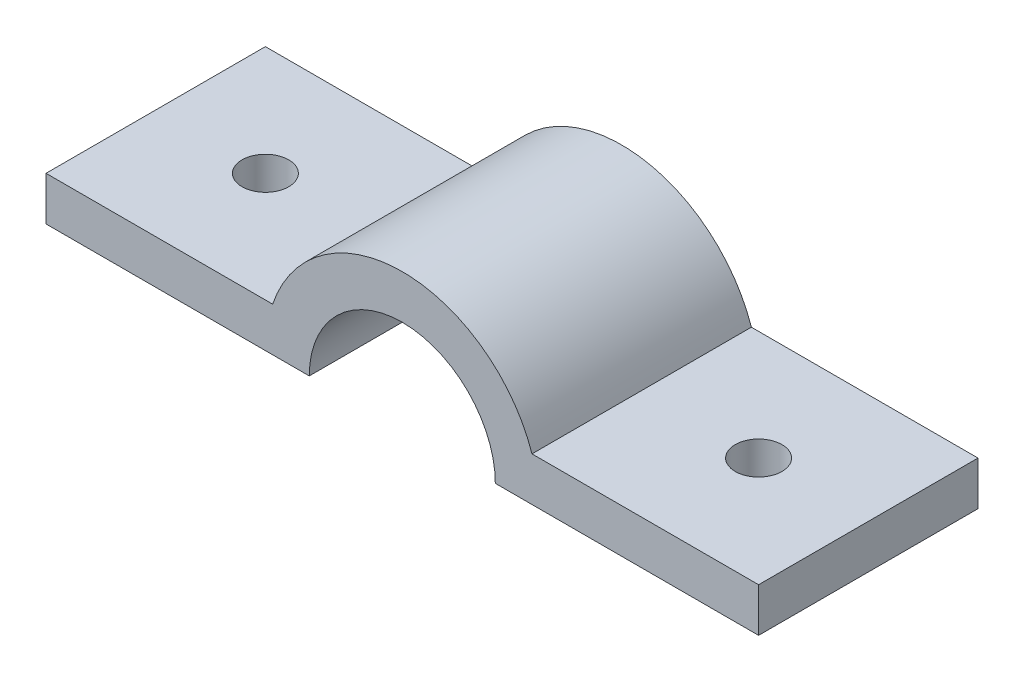
ISO-10303-21;
HEADER;
FILE_DESCRIPTION(('STEP AP214'),'2;1');
FILE_NAME('part.step','',(''),(''),'','','');
FILE_SCHEMA(('AUTOMOTIVE_DESIGN { 1 0 10303 214 1 1 1 1 }'));
ENDSEC;
DATA;
#1=APPLICATION_CONTEXT('core data for automotive mechanical design processes');
#2=APPLICATION_PROTOCOL_DEFINITION('international standard','automotive_design',2000,#1);
#3=PRODUCT_CONTEXT('',#1,'mechanical');
#4=PRODUCT('Part','Part','',(#3));
#5=PRODUCT_RELATED_PRODUCT_CATEGORY('part','',(#4));
#6=PRODUCT_DEFINITION_FORMATION('','',#4);
#7=PRODUCT_DEFINITION_CONTEXT('part definition',#1,'design');
#8=PRODUCT_DEFINITION('design','',#6,#7);
#9=PRODUCT_DEFINITION_SHAPE('','',#8);
#10=(LENGTH_UNIT() NAMED_UNIT(*) SI_UNIT(.MILLI.,.METRE.));
#11=(NAMED_UNIT(*) PLANE_ANGLE_UNIT() SI_UNIT($,.RADIAN.));
#12=(NAMED_UNIT(*) SI_UNIT($,.STERADIAN.) SOLID_ANGLE_UNIT());
#13=UNCERTAINTY_MEASURE_WITH_UNIT(LENGTH_MEASURE(1.E-05),#10,'distance_accuracy_value','');
#14=(GEOMETRIC_REPRESENTATION_CONTEXT(3) GLOBAL_UNCERTAINTY_ASSIGNED_CONTEXT((#13)) GLOBAL_UNIT_ASSIGNED_CONTEXT((#10,
#11,#12)) REPRESENTATION_CONTEXT('',''));
#15=CARTESIAN_POINT('',(0.,0.,0.));
#16=DIRECTION('',(0.,0.,1.));
#17=DIRECTION('',(1.,0.,0.));
#18=AXIS2_PLACEMENT_3D('',#15,#16,#17);
#19=CARTESIAN_POINT('',(51.562,-2.20309881449055E-13,31.75));
#20=DIRECTION('',(0.,0.,-1.));
#21=DIRECTION('',(-1.,0.,0.));
#22=AXIS2_PLACEMENT_3D('',#19,#20,#21);
#23=CYLINDRICAL_SURFACE('',#22,19.8120000001747);
#24=CARTESIAN_POINT('',(51.562,-2.20309881449055E-13,0.));
#25=DIRECTION('',(0.,0.,1.));
#26=DIRECTION('',(-1.,0.,0.));
#27=AXIS2_PLACEMENT_3D('',#24,#25,#26);
#28=CIRCLE('',#27,19.8120000001747);
#29=CARTESIAN_POINT('',(70.3288016456433,6.34999999999999,0.));
#30=VERTEX_POINT('',#29);
#31=CARTESIAN_POINT('',(32.7951983543567,6.35,0.));
#32=VERTEX_POINT('',#31);
#33=EDGE_CURVE('E129',#30,#32,#28,.T.);
#34=ORIENTED_EDGE('',*,*,#33,.T.);
#35=DIRECTION('',(0.,0.,-1.));
#36=VECTOR('',#35,1.);
#37=CARTESIAN_POINT('',(32.7951983543567,6.35,31.75));
#38=LINE('',#37,#36);
#39=CARTESIAN_POINT('',(32.7951983543567,6.35,31.75));
#40=VERTEX_POINT('',#39);
#41=EDGE_CURVE('E11',#40,#32,#38,.T.);
#42=ORIENTED_EDGE('',*,*,#41,.F.);
#43=CARTESIAN_POINT('',(51.562,-2.20309881449055E-13,31.75));
#44=DIRECTION('',(0.,0.,1.));
#45=DIRECTION('',(-1.,0.,0.));
#46=AXIS2_PLACEMENT_3D('',#43,#44,#45);
#47=CIRCLE('',#46,19.8120000001747);
#48=CARTESIAN_POINT('',(70.3288016456433,6.34999999999999,31.75));
#49=VERTEX_POINT('',#48);
#50=EDGE_CURVE('E144',#49,#40,#47,.T.);
#51=ORIENTED_EDGE('',*,*,#50,.F.);
#52=DIRECTION('',(0.,0.,-1.));
#53=VECTOR('',#52,1.);
#54=CARTESIAN_POINT('',(70.3288016456433,6.34999999999999,31.75));
#55=LINE('',#54,#53);
#56=EDGE_CURVE('E125',#49,#30,#55,.T.);
#57=ORIENTED_EDGE('',*,*,#56,.T.);
#58=EDGE_LOOP('',(#34,#42,#51,#57));
#59=FACE_BOUND('',#58,.T.);
#60=ADVANCED_FACE('F33',(#59),#23,.T.);
#61=CARTESIAN_POINT('',(32.7951983543567,6.35,31.75));
#62=DIRECTION('',(0.,-1.,0.));
#63=DIRECTION('',(1.,0.,0.));
#64=AXIS2_PLACEMENT_3D('',#61,#62,#63);
#65=PLANE('',#64);
#66=CARTESIAN_POINT('',(15.875,6.35,15.875));
#67=DIRECTION('',(0.,1.,0.));
#68=DIRECTION('',(-1.,0.,0.));
#69=AXIS2_PLACEMENT_3D('',#66,#67,#68);
#70=CIRCLE('',#69,3.3782);
#71=CARTESIAN_POINT('',(12.4968,6.35,15.875));
#72=VERTEX_POINT('',#71);
#73=EDGE_CURVE('E183',#72,#72,#70,.T.);
#74=ORIENTED_EDGE('',*,*,#73,.F.);
#75=EDGE_LOOP('',(#74));
#76=FACE_BOUND('',#75,.T.);
#77=DIRECTION('',(-1.,0.,0.));
#78=VECTOR('',#77,1.);
#79=CARTESIAN_POINT('',(32.7951983543567,6.35,0.));
#80=LINE('',#79,#78);
#81=CARTESIAN_POINT('',(0.,6.35,0.));
#82=VERTEX_POINT('',#81);
#83=EDGE_CURVE('E132',#32,#82,#80,.T.);
#84=ORIENTED_EDGE('',*,*,#83,.T.);
#85=DIRECTION('',(0.,0.,-1.));
#86=VECTOR('',#85,1.);
#87=CARTESIAN_POINT('',(0.,6.35,31.75));
#88=LINE('',#87,#86);
#89=CARTESIAN_POINT('',(0.,6.35,31.75));
#90=VERTEX_POINT('',#89);
#91=EDGE_CURVE('E41',#90,#82,#88,.T.);
#92=ORIENTED_EDGE('',*,*,#91,.F.);
#93=DIRECTION('',(-1.,0.,0.));
#94=VECTOR('',#93,1.);
#95=CARTESIAN_POINT('',(32.7951983543567,6.35,31.75));
#96=LINE('',#95,#94);
#97=EDGE_CURVE('E92',#40,#90,#96,.T.);
#98=ORIENTED_EDGE('',*,*,#97,.F.);
#99=ORIENTED_EDGE('',*,*,#41,.T.);
#100=EDGE_LOOP('',(#84,#92,#98,#99));
#101=FACE_BOUND('',#100,.T.);
#102=ADVANCED_FACE('F197',(#76,#101),#65,.F.);
#103=CARTESIAN_POINT('',(0.,6.35,31.75));
#104=DIRECTION('',(1.,0.,0.));
#105=DIRECTION('',(0.,1.,0.));
#106=AXIS2_PLACEMENT_3D('',#103,#104,#105);
#107=PLANE('',#106);
#108=DIRECTION('',(0.,-1.,0.));
#109=VECTOR('',#108,1.);
#110=CARTESIAN_POINT('',(0.,6.35,0.));
#111=LINE('',#110,#109);
#112=CARTESIAN_POINT('',(0.,0.,0.));
#113=VERTEX_POINT('',#112);
#114=EDGE_CURVE('E135',#82,#113,#111,.T.);
#115=ORIENTED_EDGE('',*,*,#114,.T.);
#116=DIRECTION('',(0.,0.,-1.));
#117=VECTOR('',#116,1.);
#118=CARTESIAN_POINT('',(0.,0.,31.75));
#119=LINE('',#118,#117);
#120=CARTESIAN_POINT('',(0.,0.,31.75));
#121=VERTEX_POINT('',#120);
#122=EDGE_CURVE('E151',#121,#113,#119,.T.);
#123=ORIENTED_EDGE('',*,*,#122,.F.);
#124=DIRECTION('',(0.,-1.,0.));
#125=VECTOR('',#124,1.);
#126=CARTESIAN_POINT('',(0.,6.35,31.75));
#127=LINE('',#126,#125);
#128=EDGE_CURVE('E159',#90,#121,#127,.T.);
#129=ORIENTED_EDGE('',*,*,#128,.F.);
#130=ORIENTED_EDGE('',*,*,#91,.T.);
#131=EDGE_LOOP('',(#115,#123,#129,#130));
#132=FACE_BOUND('',#131,.T.);
#133=ADVANCED_FACE('F157',(#132),#107,.F.);
#134=CARTESIAN_POINT('',(0.,0.,31.75));
#135=DIRECTION('',(0.,1.,0.));
#136=DIRECTION('',(0.,0.,1.));
#137=AXIS2_PLACEMENT_3D('',#134,#135,#136);
#138=PLANE('',#137);
#139=CARTESIAN_POINT('',(15.875,0.,15.875));
#140=DIRECTION('',(0.,1.,0.));
#141=DIRECTION('',(-1.,0.,0.));
#142=AXIS2_PLACEMENT_3D('',#139,#140,#141);
#143=CIRCLE('',#142,3.3782);
#144=CARTESIAN_POINT('',(12.4968,0.,15.875));
#145=VERTEX_POINT('',#144);
#146=EDGE_CURVE('E133',#145,#145,#143,.T.);
#147=ORIENTED_EDGE('',*,*,#146,.T.);
#148=EDGE_LOOP('',(#147));
#149=FACE_BOUND('',#148,.T.);
#150=DIRECTION('',(1.,0.,0.));
#151=VECTOR('',#150,1.);
#152=CARTESIAN_POINT('',(0.,0.,0.));
#153=LINE('',#152,#151);
#154=CARTESIAN_POINT('',(38.1,0.,0.));
#155=VERTEX_POINT('',#154);
#156=EDGE_CURVE('E137',#113,#155,#153,.T.);
#157=ORIENTED_EDGE('',*,*,#156,.T.);
#158=DIRECTION('',(0.,0.,-1.));
#159=VECTOR('',#158,1.);
#160=CARTESIAN_POINT('',(38.1,0.,31.75));
#161=LINE('',#160,#159);
#162=CARTESIAN_POINT('',(38.1,0.,31.75));
#163=VERTEX_POINT('',#162);
#164=EDGE_CURVE('E148',#163,#155,#161,.T.);
#165=ORIENTED_EDGE('',*,*,#164,.F.);
#166=DIRECTION('',(1.,0.,0.));
#167=VECTOR('',#166,1.);
#168=CARTESIAN_POINT('',(0.,0.,31.75));
#169=LINE('',#168,#167);
#170=EDGE_CURVE('E171',#121,#163,#169,.T.);
#171=ORIENTED_EDGE('',*,*,#170,.F.);
#172=ORIENTED_EDGE('',*,*,#122,.T.);
#173=EDGE_LOOP('',(#157,#165,#171,#172));
#174=FACE_BOUND('',#173,.T.);
#175=ADVANCED_FACE('F167',(#149,#174),#138,.F.);
#176=CARTESIAN_POINT('',(51.562,-2.20309881449055E-13,31.75));
#177=DIRECTION('',(0.,0.,-1.));
#178=DIRECTION('',(-1.,0.,0.));
#179=AXIS2_PLACEMENT_3D('',#176,#177,#178);
#180=CYLINDRICAL_SURFACE('',#179,13.462);
#181=CARTESIAN_POINT('',(51.562,-2.20309881449055E-13,0.));
#182=DIRECTION('',(0.,0.,-1.));
#183=DIRECTION('',(-1.,0.,0.));
#184=AXIS2_PLACEMENT_3D('',#181,#182,#183);
#185=CIRCLE('',#184,13.462);
#186=CARTESIAN_POINT('',(65.024,0.,0.));
#187=VERTEX_POINT('',#186);
#188=EDGE_CURVE('E139',#155,#187,#185,.T.);
#189=ORIENTED_EDGE('',*,*,#188,.T.);
#190=DIRECTION('',(0.,0.,-1.));
#191=VECTOR('',#190,1.);
#192=CARTESIAN_POINT('',(65.024,0.,31.75));
#193=LINE('',#192,#191);
#194=CARTESIAN_POINT('',(65.024,0.,31.75));
#195=VERTEX_POINT('',#194);
#196=EDGE_CURVE('E120',#195,#187,#193,.T.);
#197=ORIENTED_EDGE('',*,*,#196,.F.);
#198=CARTESIAN_POINT('',(51.562,-2.20309881449055E-13,31.75));
#199=DIRECTION('',(0.,0.,-1.));
#200=DIRECTION('',(-1.,0.,0.));
#201=AXIS2_PLACEMENT_3D('',#198,#199,#200);
#202=CIRCLE('',#201,13.462);
#203=EDGE_CURVE('E111',#163,#195,#202,.T.);
#204=ORIENTED_EDGE('',*,*,#203,.F.);
#205=ORIENTED_EDGE('',*,*,#164,.T.);
#206=EDGE_LOOP('',(#189,#197,#204,#205));
#207=FACE_BOUND('',#206,.T.);
#208=ADVANCED_FACE('F170',(#207),#180,.F.);
#209=CARTESIAN_POINT('',(103.124,0.,31.75));
#210=DIRECTION('',(0.,1.,0.));
#211=DIRECTION('',(-1.,0.,0.));
#212=AXIS2_PLACEMENT_3D('',#209,#210,#211);
#213=PLANE('',#212);
#214=CARTESIAN_POINT('',(87.249,0.,15.875));
#215=DIRECTION('',(0.,1.,0.));
#216=DIRECTION('',(-1.,0.,0.));
#217=AXIS2_PLACEMENT_3D('',#214,#215,#216);
#218=CIRCLE('',#217,3.37819999999999);
#219=CARTESIAN_POINT('',(83.8708,0.,15.875));
#220=VERTEX_POINT('',#219);
#221=EDGE_CURVE('E177',#220,#220,#218,.T.);
#222=ORIENTED_EDGE('',*,*,#221,.T.);
#223=EDGE_LOOP('',(#222));
#224=FACE_BOUND('',#223,.T.);
#225=DIRECTION('',(1.,0.,0.));
#226=VECTOR('',#225,1.);
#227=CARTESIAN_POINT('',(103.124,0.,0.));
#228=LINE('',#227,#226);
#229=CARTESIAN_POINT('',(103.124,0.,0.));
#230=VERTEX_POINT('',#229);
#231=EDGE_CURVE('E119',#187,#230,#228,.T.);
#232=ORIENTED_EDGE('',*,*,#231,.T.);
#233=DIRECTION('',(0.,0.,-1.));
#234=VECTOR('',#233,1.);
#235=CARTESIAN_POINT('',(103.124,0.,31.75));
#236=LINE('',#235,#234);
#237=CARTESIAN_POINT('',(103.124,0.,31.75));
#238=VERTEX_POINT('',#237);
#239=EDGE_CURVE('E116',#238,#230,#236,.T.);
#240=ORIENTED_EDGE('',*,*,#239,.F.);
#241=DIRECTION('',(1.,0.,0.));
#242=VECTOR('',#241,1.);
#243=CARTESIAN_POINT('',(103.124,0.,31.75));
#244=LINE('',#243,#242);
#245=EDGE_CURVE('E105',#195,#238,#244,.T.);
#246=ORIENTED_EDGE('',*,*,#245,.F.);
#247=ORIENTED_EDGE('',*,*,#196,.T.);
#248=EDGE_LOOP('',(#232,#240,#246,#247));
#249=FACE_BOUND('',#248,.T.);
#250=ADVANCED_FACE('F117',(#224,#249),#213,.F.);
#251=CARTESIAN_POINT('',(103.124,6.35,31.75));
#252=DIRECTION('',(-1.,0.,0.));
#253=DIRECTION('',(0.,0.,1.));
#254=AXIS2_PLACEMENT_3D('',#251,#252,#253);
#255=PLANE('',#254);
#256=DIRECTION('',(0.,1.,0.));
#257=VECTOR('',#256,1.);
#258=CARTESIAN_POINT('',(103.124,6.35,0.));
#259=LINE('',#258,#257);
#260=CARTESIAN_POINT('',(103.124,6.35,0.));
#261=VERTEX_POINT('',#260);
#262=EDGE_CURVE('E78',#230,#261,#259,.T.);
#263=ORIENTED_EDGE('',*,*,#262,.T.);
#264=DIRECTION('',(0.,0.,-1.));
#265=VECTOR('',#264,1.);
#266=CARTESIAN_POINT('',(103.124,6.35,31.75));
#267=LINE('',#266,#265);
#268=CARTESIAN_POINT('',(103.124,6.35,31.75));
#269=VERTEX_POINT('',#268);
#270=EDGE_CURVE('E121',#269,#261,#267,.T.);
#271=ORIENTED_EDGE('',*,*,#270,.F.);
#272=DIRECTION('',(0.,1.,0.));
#273=VECTOR('',#272,1.);
#274=CARTESIAN_POINT('',(103.124,6.35,31.75));
#275=LINE('',#274,#273);
#276=EDGE_CURVE('E109',#238,#269,#275,.T.);
#277=ORIENTED_EDGE('',*,*,#276,.F.);
#278=ORIENTED_EDGE('',*,*,#239,.T.);
#279=EDGE_LOOP('',(#263,#271,#277,#278));
#280=FACE_BOUND('',#279,.T.);
#281=ADVANCED_FACE('F123',(#280),#255,.F.);
#282=CARTESIAN_POINT('',(70.3288016456433,6.34999999999999,31.75));
#283=DIRECTION('',(0.,-1.,0.));
#284=DIRECTION('',(1.,0.,0.));
#285=AXIS2_PLACEMENT_3D('',#282,#283,#284);
#286=PLANE('',#285);
#287=CARTESIAN_POINT('',(87.249,6.35000000000001,15.875));
#288=DIRECTION('',(0.,1.,0.));
#289=DIRECTION('',(-1.,0.,0.));
#290=AXIS2_PLACEMENT_3D('',#287,#288,#289);
#291=CIRCLE('',#290,3.37819999999999);
#292=CARTESIAN_POINT('',(83.8708,6.35000000000001,15.875));
#293=VERTEX_POINT('',#292);
#294=EDGE_CURVE('E180',#293,#293,#291,.T.);
#295=ORIENTED_EDGE('',*,*,#294,.F.);
#296=EDGE_LOOP('',(#295));
#297=FACE_BOUND('',#296,.T.);
#298=DIRECTION('',(-1.,0.,0.));
#299=VECTOR('',#298,1.);
#300=CARTESIAN_POINT('',(70.3288016456433,6.34999999999999,0.));
#301=LINE('',#300,#299);
#302=EDGE_CURVE('E84',#261,#30,#301,.T.);
#303=ORIENTED_EDGE('',*,*,#302,.T.);
#304=ORIENTED_EDGE('',*,*,#56,.F.);
#305=DIRECTION('',(-1.,0.,0.));
#306=VECTOR('',#305,1.);
#307=CARTESIAN_POINT('',(70.3288016456433,6.34999999999999,31.75));
#308=LINE('',#307,#306);
#309=EDGE_CURVE('E49',#269,#49,#308,.T.);
#310=ORIENTED_EDGE('',*,*,#309,.F.);
#311=ORIENTED_EDGE('',*,*,#270,.T.);
#312=EDGE_LOOP('',(#303,#304,#310,#311));
#313=FACE_BOUND('',#312,.T.);
#314=ADVANCED_FACE('F202',(#297,#313),#286,.F.);
#315=CARTESIAN_POINT('',(51.562,-2.20309881449055E-13,31.75));
#316=DIRECTION('',(0.,0.,-1.));
#317=DIRECTION('',(-1.,0.,0.));
#318=AXIS2_PLACEMENT_3D('',#315,#316,#317);
#319=PLANE('',#318);
#320=ORIENTED_EDGE('',*,*,#50,.T.);
#321=ORIENTED_EDGE('',*,*,#97,.T.);
#322=ORIENTED_EDGE('',*,*,#128,.T.);
#323=ORIENTED_EDGE('',*,*,#170,.T.);
#324=ORIENTED_EDGE('',*,*,#203,.T.);
#325=ORIENTED_EDGE('',*,*,#245,.T.);
#326=ORIENTED_EDGE('',*,*,#276,.T.);
#327=ORIENTED_EDGE('',*,*,#309,.T.);
#328=EDGE_LOOP('',(#320,#321,#322,#323,#324,#325,#326,#327));
#329=FACE_BOUND('',#328,.T.);
#330=ADVANCED_FACE('F107',(#329),#319,.F.);
#331=CARTESIAN_POINT('',(51.562,-2.20309881449055E-13,0.));
#332=DIRECTION('',(0.,0.,-1.));
#333=DIRECTION('',(-1.,0.,0.));
#334=AXIS2_PLACEMENT_3D('',#331,#332,#333);
#335=PLANE('',#334);
#336=ORIENTED_EDGE('',*,*,#33,.F.);
#337=ORIENTED_EDGE('',*,*,#302,.F.);
#338=ORIENTED_EDGE('',*,*,#262,.F.);
#339=ORIENTED_EDGE('',*,*,#231,.F.);
#340=ORIENTED_EDGE('',*,*,#188,.F.);
#341=ORIENTED_EDGE('',*,*,#156,.F.);
#342=ORIENTED_EDGE('',*,*,#114,.F.);
#343=ORIENTED_EDGE('',*,*,#83,.F.);
#344=EDGE_LOOP('',(#336,#337,#338,#339,#340,#341,#342,#343));
#345=FACE_BOUND('',#344,.T.);
#346=ADVANCED_FACE('F163',(#345),#335,.T.);
#347=CARTESIAN_POINT('',(87.249,0.,15.875));
#348=DIRECTION('',(0.,1.,0.));
#349=DIRECTION('',(-1.,0.,0.));
#350=AXIS2_PLACEMENT_3D('',#347,#348,#349);
#351=CYLINDRICAL_SURFACE('',#350,3.37819999999999);
#352=ORIENTED_EDGE('',*,*,#221,.F.);
#353=EDGE_LOOP('',(#352));
#354=FACE_BOUND('',#353,.T.);
#355=ORIENTED_EDGE('',*,*,#294,.T.);
#356=EDGE_LOOP('',(#355));
#357=FACE_BOUND('',#356,.T.);
#358=ADVANCED_FACE('F193',(#354,#357),#351,.F.);
#359=CARTESIAN_POINT('',(15.875,0.,15.875));
#360=DIRECTION('',(0.,1.,0.));
#361=DIRECTION('',(-1.,0.,0.));
#362=AXIS2_PLACEMENT_3D('',#359,#360,#361);
#363=CYLINDRICAL_SURFACE('',#362,3.3782);
#364=ORIENTED_EDGE('',*,*,#146,.F.);
#365=EDGE_LOOP('',(#364));
#366=FACE_BOUND('',#365,.T.);
#367=ORIENTED_EDGE('',*,*,#73,.T.);
#368=EDGE_LOOP('',(#367));
#369=FACE_BOUND('',#368,.T.);
#370=ADVANCED_FACE('F190',(#366,#369),#363,.F.);
#371=CLOSED_SHELL('',(#60,#102,#133,#175,#208,#250,#281,#314,#330,#346,#358,#370));
#372=MANIFOLD_SOLID_BREP('B2',#371);
#373=ADVANCED_BREP_SHAPE_REPRESENTATION('',(#18,#372),#14);
#374=SHAPE_DEFINITION_REPRESENTATION(#9,#373);
ENDSEC;
END-ISO-10303-21;
